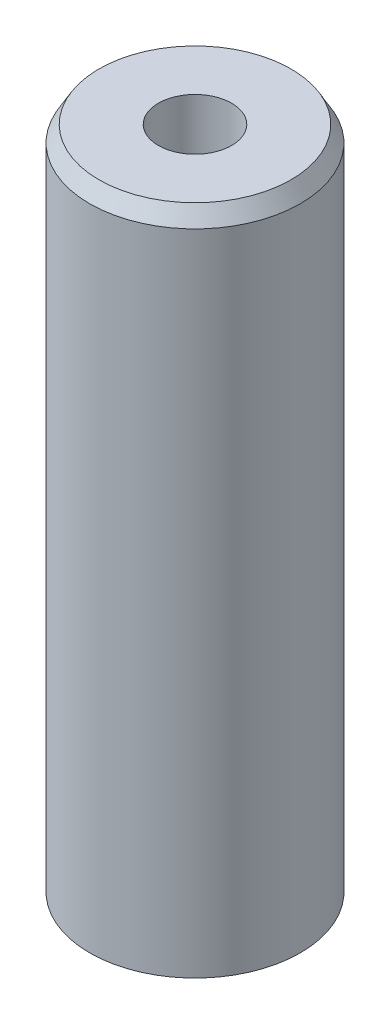
ISO-10303-21;
HEADER;
FILE_DESCRIPTION(('STEP AP214'),'2;1');
FILE_NAME('part.step','',(''),(''),'','','');
FILE_SCHEMA(('AUTOMOTIVE_DESIGN { 1 0 10303 214 1 1 1 1 }'));
ENDSEC;
DATA;
#1=APPLICATION_CONTEXT('core data for automotive mechanical design processes');
#2=APPLICATION_PROTOCOL_DEFINITION('international standard','automotive_design',2000,#1);
#3=PRODUCT_CONTEXT('',#1,'mechanical');
#4=PRODUCT('Part','Part','',(#3));
#5=PRODUCT_RELATED_PRODUCT_CATEGORY('part','',(#4));
#6=PRODUCT_DEFINITION_FORMATION('','',#4);
#7=PRODUCT_DEFINITION_CONTEXT('part definition',#1,'design');
#8=PRODUCT_DEFINITION('design','',#6,#7);
#9=PRODUCT_DEFINITION_SHAPE('','',#8);
#10=(LENGTH_UNIT() NAMED_UNIT(*) SI_UNIT(.MILLI.,.METRE.));
#11=(NAMED_UNIT(*) PLANE_ANGLE_UNIT() SI_UNIT($,.RADIAN.));
#12=(NAMED_UNIT(*) SI_UNIT($,.STERADIAN.) SOLID_ANGLE_UNIT());
#13=UNCERTAINTY_MEASURE_WITH_UNIT(LENGTH_MEASURE(1.E-05),#10,'distance_accuracy_value','');
#14=(GEOMETRIC_REPRESENTATION_CONTEXT(3) GLOBAL_UNCERTAINTY_ASSIGNED_CONTEXT((#13)) GLOBAL_UNIT_ASSIGNED_CONTEXT((#10,
#11,#12)) REPRESENTATION_CONTEXT('',''));
#15=CARTESIAN_POINT('',(0.,0.,0.));
#16=DIRECTION('',(0.,0.,1.));
#17=DIRECTION('',(1.,0.,0.));
#18=AXIS2_PLACEMENT_3D('',#15,#16,#17);
#19=CARTESIAN_POINT('',(0.,48.0075903939062,0.));
#20=DIRECTION('',(0.,-1.,0.));
#21=DIRECTION('',(0.,0.,-1.));
#22=AXIS2_PLACEMENT_3D('',#19,#20,#21);
#23=CYLINDRICAL_SURFACE('',#22,7.5);
#24=CARTESIAN_POINT('',(0.,46.8616264982809,0.));
#25=DIRECTION('',(0.,1.,0.));
#26=DIRECTION('',(0.,0.,1.));
#27=AXIS2_PLACEMENT_3D('',#24,#25,#26);
#28=CIRCLE('',#27,7.5);
#29=CARTESIAN_POINT('',(0.,46.8616264982809,7.5));
#30=VERTEX_POINT('',#29);
#31=EDGE_CURVE('E50',#30,#30,#28,.F.);
#32=ORIENTED_EDGE('',*,*,#31,.T.);
#33=EDGE_LOOP('',(#32));
#34=FACE_BOUND('',#33,.T.);
#35=CARTESIAN_POINT('',(0.,0.661622563620859,0.));
#36=DIRECTION('',(0.,1.,0.));
#37=DIRECTION('',(0.,0.,1.));
#38=AXIS2_PLACEMENT_3D('',#35,#36,#37);
#39=CIRCLE('',#38,7.5);
#40=CARTESIAN_POINT('',(0.,0.661622563620859,7.5));
#41=VERTEX_POINT('',#40);
#42=EDGE_CURVE('E51',#41,#41,#39,.T.);
#43=ORIENTED_EDGE('',*,*,#42,.T.);
#44=EDGE_LOOP('',(#43));
#45=FACE_BOUND('',#44,.T.);
#46=ADVANCED_FACE('F39',(#34,#45),#23,.T.);
#47=CARTESIAN_POINT('',(0.,48.0075903939062,0.));
#48=DIRECTION('',(0.,1.,0.));
#49=DIRECTION('',(0.,0.,1.));
#50=AXIS2_PLACEMENT_3D('',#47,#48,#49);
#51=PLANE('',#50);
#52=CARTESIAN_POINT('',(0.,48.0075903939062,0.));
#53=DIRECTION('',(0.,1.,0.));
#54=DIRECTION('',(0.,0.,1.));
#55=AXIS2_PLACEMENT_3D('',#52,#53,#54);
#56=CIRCLE('',#55,6.83837743637915);
#57=CARTESIAN_POINT('',(0.,48.0075903939062,6.83837743637915));
#58=VERTEX_POINT('',#57);
#59=EDGE_CURVE('E54',#58,#58,#56,.T.);
#60=ORIENTED_EDGE('',*,*,#59,.T.);
#61=EDGE_LOOP('',(#60));
#62=FACE_BOUND('',#61,.T.);
#63=CARTESIAN_POINT('',(0.,48.0075903939062,0.));
#64=DIRECTION('',(0.,1.,0.));
#65=DIRECTION('',(0.,0.,1.));
#66=AXIS2_PLACEMENT_3D('',#63,#64,#65);
#67=CIRCLE('',#66,2.60987968869521);
#68=CARTESIAN_POINT('',(0.,48.0075903939062,2.60987968869521));
#69=VERTEX_POINT('',#68);
#70=EDGE_CURVE('E58',#69,#69,#67,.T.);
#71=ORIENTED_EDGE('',*,*,#70,.F.);
#72=EDGE_LOOP('',(#71));
#73=FACE_BOUND('',#72,.T.);
#74=ADVANCED_FACE('F69',(#62,#73),#51,.T.);
#75=CARTESIAN_POINT('',(0.,0.,0.));
#76=DIRECTION('',(0.,1.,0.));
#77=DIRECTION('',(0.,0.,1.));
#78=AXIS2_PLACEMENT_3D('',#75,#76,#77);
#79=PLANE('',#78);
#80=CARTESIAN_POINT('',(0.,0.,0.));
#81=DIRECTION('',(0.,1.,0.));
#82=DIRECTION('',(0.,0.,1.));
#83=AXIS2_PLACEMENT_3D('',#80,#81,#82);
#84=CIRCLE('',#83,6.35403610437469);
#85=CARTESIAN_POINT('',(0.,0.,6.35403610437469));
#86=VERTEX_POINT('',#85);
#87=EDGE_CURVE('E10',#86,#86,#84,.F.);
#88=ORIENTED_EDGE('',*,*,#87,.T.);
#89=EDGE_LOOP('',(#88));
#90=FACE_BOUND('',#89,.T.);
#91=CARTESIAN_POINT('',(0.,0.,0.));
#92=DIRECTION('',(0.,1.,0.));
#93=DIRECTION('',(0.,0.,1.));
#94=AXIS2_PLACEMENT_3D('',#91,#92,#93);
#95=CIRCLE('',#94,2.60987968869521);
#96=CARTESIAN_POINT('',(0.,0.,2.60987968869521));
#97=VERTEX_POINT('',#96);
#98=EDGE_CURVE('E63',#97,#97,#95,.T.);
#99=ORIENTED_EDGE('',*,*,#98,.T.);
#100=EDGE_LOOP('',(#99));
#101=FACE_BOUND('',#100,.T.);
#102=ADVANCED_FACE('F75',(#90,#101),#79,.F.);
#103=CARTESIAN_POINT('',(0.,48.0075903939062,0.));
#104=DIRECTION('',(0.,-1.,0.));
#105=DIRECTION('',(0.,0.,-1.));
#106=AXIS2_PLACEMENT_3D('',#103,#104,#105);
#107=CYLINDRICAL_SURFACE('',#106,2.60987968869521);
#108=ORIENTED_EDGE('',*,*,#70,.T.);
#109=EDGE_LOOP('',(#108));
#110=FACE_BOUND('',#109,.T.);
#111=ORIENTED_EDGE('',*,*,#98,.F.);
#112=EDGE_LOOP('',(#111));
#113=FACE_BOUND('',#112,.T.);
#114=ADVANCED_FACE('F70',(#110,#113),#107,.F.);
#115=CARTESIAN_POINT('',(0.,48.0075903939062,0.));
#116=DIRECTION('',(0.,-1.,0.));
#117=DIRECTION('',(0.,0.,-1.));
#118=AXIS2_PLACEMENT_3D('',#115,#116,#117);
#119=CONICAL_SURFACE('',#118,6.83837743637915,0.523598775598291);
#120=ORIENTED_EDGE('',*,*,#31,.F.);
#121=EDGE_LOOP('',(#120));
#122=FACE_BOUND('',#121,.T.);
#123=ORIENTED_EDGE('',*,*,#59,.F.);
#124=EDGE_LOOP('',(#123));
#125=FACE_BOUND('',#124,.T.);
#126=ADVANCED_FACE('F81',(#122,#125),#119,.T.);
#127=CARTESIAN_POINT('',(0.,0.661622563620859,0.));
#128=DIRECTION('',(0.,1.,0.));
#129=DIRECTION('',(0.,0.,1.));
#130=AXIS2_PLACEMENT_3D('',#127,#128,#129);
#131=CONICAL_SURFACE('',#130,7.5,1.0471975511966);
#132=ORIENTED_EDGE('',*,*,#87,.F.);
#133=EDGE_LOOP('',(#132));
#134=FACE_BOUND('',#133,.T.);
#135=ORIENTED_EDGE('',*,*,#42,.F.);
#136=EDGE_LOOP('',(#135));
#137=FACE_BOUND('',#136,.T.);
#138=ADVANCED_FACE('F45',(#134,#137),#131,.T.);
#139=CLOSED_SHELL('',(#46,#74,#102,#114,#126,#138));
#140=MANIFOLD_SOLID_BREP('B2',#139);
#141=ADVANCED_BREP_SHAPE_REPRESENTATION('',(#18,#140),#14);
#142=SHAPE_DEFINITION_REPRESENTATION(#9,#141);
ENDSEC;
END-ISO-10303-21;
